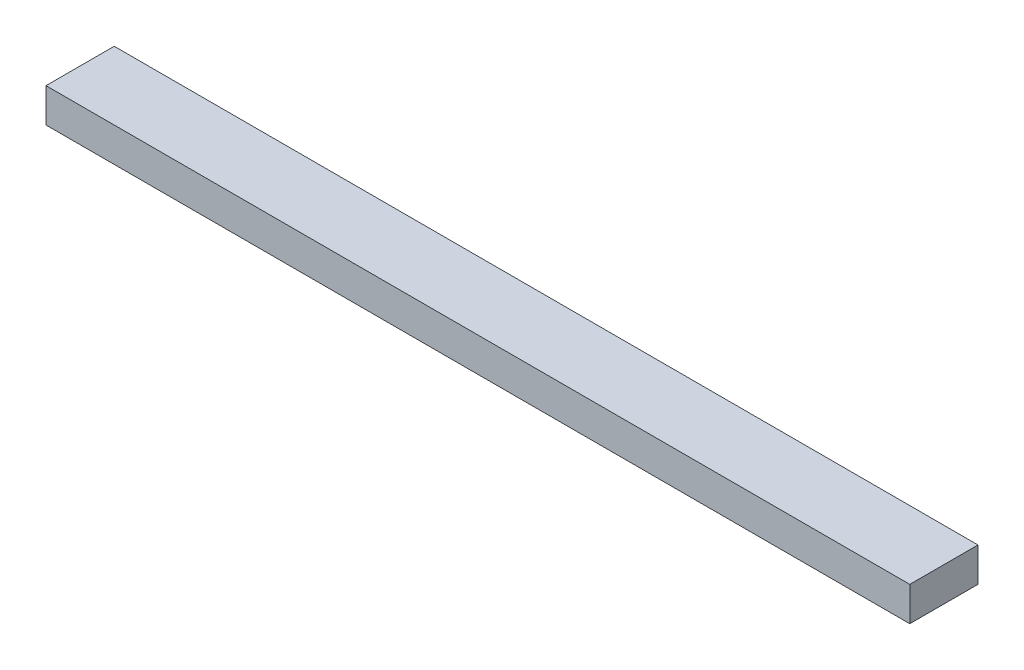
ISO-10303-21;
HEADER;
FILE_DESCRIPTION(('STEP AP214'),'2;1');
FILE_NAME('part.step','',(''),(''),'','','');
FILE_SCHEMA(('AUTOMOTIVE_DESIGN { 1 0 10303 214 1 1 1 1 }'));
ENDSEC;
DATA;
#1=APPLICATION_CONTEXT('core data for automotive mechanical design processes');
#2=APPLICATION_PROTOCOL_DEFINITION('international standard','automotive_design',2000,#1);
#3=PRODUCT_CONTEXT('',#1,'mechanical');
#4=PRODUCT('Part','Part','',(#3));
#5=PRODUCT_RELATED_PRODUCT_CATEGORY('part','',(#4));
#6=PRODUCT_DEFINITION_FORMATION('','',#4);
#7=PRODUCT_DEFINITION_CONTEXT('part definition',#1,'design');
#8=PRODUCT_DEFINITION('design','',#6,#7);
#9=PRODUCT_DEFINITION_SHAPE('','',#8);
#10=(LENGTH_UNIT() NAMED_UNIT(*) SI_UNIT(.MILLI.,.METRE.));
#11=(NAMED_UNIT(*) PLANE_ANGLE_UNIT() SI_UNIT($,.RADIAN.));
#12=(NAMED_UNIT(*) SI_UNIT($,.STERADIAN.) SOLID_ANGLE_UNIT());
#13=UNCERTAINTY_MEASURE_WITH_UNIT(LENGTH_MEASURE(1.E-05),#10,'distance_accuracy_value','');
#14=(GEOMETRIC_REPRESENTATION_CONTEXT(3) GLOBAL_UNCERTAINTY_ASSIGNED_CONTEXT((#13)) GLOBAL_UNIT_ASSIGNED_CONTEXT((#10,
#11,#12)) REPRESENTATION_CONTEXT('',''));
#15=CARTESIAN_POINT('',(0.,0.,0.));
#16=DIRECTION('',(0.,0.,1.));
#17=DIRECTION('',(1.,0.,0.));
#18=AXIS2_PLACEMENT_3D('',#15,#16,#17);
#19=CARTESIAN_POINT('',(80.391,6.35,6.35));
#20=DIRECTION('',(-1.,0.,0.));
#21=DIRECTION('',(0.,0.,1.));
#22=AXIS2_PLACEMENT_3D('',#19,#20,#21);
#23=PLANE('',#22);
#24=DIRECTION('',(0.,0.,-1.));
#25=VECTOR('',#24,1.);
#26=CARTESIAN_POINT('',(80.391,0.,6.35));
#27=LINE('',#26,#25);
#28=CARTESIAN_POINT('',(80.391,0.,6.35));
#29=VERTEX_POINT('',#28);
#30=CARTESIAN_POINT('',(80.391,0.,-6.35));
#31=VERTEX_POINT('',#30);
#32=EDGE_CURVE('E96',#29,#31,#27,.T.);
#33=ORIENTED_EDGE('',*,*,#32,.T.);
#34=DIRECTION('',(0.,-1.,0.));
#35=VECTOR('',#34,1.);
#36=CARTESIAN_POINT('',(80.391,6.35,-6.35));
#37=LINE('',#36,#35);
#38=CARTESIAN_POINT('',(80.391,6.35,-6.35));
#39=VERTEX_POINT('',#38);
#40=EDGE_CURVE('E11',#39,#31,#37,.T.);
#41=ORIENTED_EDGE('',*,*,#40,.F.);
#42=DIRECTION('',(0.,0.,-1.));
#43=VECTOR('',#42,1.);
#44=CARTESIAN_POINT('',(80.391,6.35,6.35));
#45=LINE('',#44,#43);
#46=CARTESIAN_POINT('',(80.391,6.35,6.35));
#47=VERTEX_POINT('',#46);
#48=EDGE_CURVE('E84',#47,#39,#45,.T.);
#49=ORIENTED_EDGE('',*,*,#48,.F.);
#50=DIRECTION('',(0.,-1.,0.));
#51=VECTOR('',#50,1.);
#52=CARTESIAN_POINT('',(80.391,6.35,6.35));
#53=LINE('',#52,#51);
#54=EDGE_CURVE('E92',#47,#29,#53,.T.);
#55=ORIENTED_EDGE('',*,*,#54,.T.);
#56=EDGE_LOOP('',(#33,#41,#49,#55));
#57=FACE_BOUND('',#56,.T.);
#58=ADVANCED_FACE('F33',(#57),#23,.F.);
#59=CARTESIAN_POINT('',(-80.391,6.35,-6.35));
#60=DIRECTION('',(0.,0.,1.));
#61=DIRECTION('',(1.,0.,0.));
#62=AXIS2_PLACEMENT_3D('',#59,#60,#61);
#63=PLANE('',#62);
#64=DIRECTION('',(-1.,0.,0.));
#65=VECTOR('',#64,1.);
#66=CARTESIAN_POINT('',(-80.391,0.,-6.35));
#67=LINE('',#66,#65);
#68=CARTESIAN_POINT('',(-80.391,0.,-6.35));
#69=VERTEX_POINT('',#68);
#70=EDGE_CURVE('E88',#31,#69,#67,.T.);
#71=ORIENTED_EDGE('',*,*,#70,.T.);
#72=DIRECTION('',(0.,-1.,0.));
#73=VECTOR('',#72,1.);
#74=CARTESIAN_POINT('',(-80.391,6.35,-6.35));
#75=LINE('',#74,#73);
#76=CARTESIAN_POINT('',(-80.391,6.35,-6.35));
#77=VERTEX_POINT('',#76);
#78=EDGE_CURVE('E41',#77,#69,#75,.T.);
#79=ORIENTED_EDGE('',*,*,#78,.F.);
#80=DIRECTION('',(-1.,0.,0.));
#81=VECTOR('',#80,1.);
#82=CARTESIAN_POINT('',(-80.391,6.35,-6.35));
#83=LINE('',#82,#81);
#84=EDGE_CURVE('E79',#39,#77,#83,.T.);
#85=ORIENTED_EDGE('',*,*,#84,.F.);
#86=ORIENTED_EDGE('',*,*,#40,.T.);
#87=EDGE_LOOP('',(#71,#79,#85,#86));
#88=FACE_BOUND('',#87,.T.);
#89=ADVANCED_FACE('F87',(#88),#63,.F.);
#90=CARTESIAN_POINT('',(-80.391,6.35,6.35));
#91=DIRECTION('',(1.,0.,0.));
#92=DIRECTION('',(0.,0.,-1.));
#93=AXIS2_PLACEMENT_3D('',#90,#91,#92);
#94=PLANE('',#93);
#95=DIRECTION('',(0.,0.,1.));
#96=VECTOR('',#95,1.);
#97=CARTESIAN_POINT('',(-80.391,0.,6.35));
#98=LINE('',#97,#96);
#99=CARTESIAN_POINT('',(-80.391,0.,6.35));
#100=VERTEX_POINT('',#99);
#101=EDGE_CURVE('E66',#69,#100,#98,.T.);
#102=ORIENTED_EDGE('',*,*,#101,.T.);
#103=DIRECTION('',(0.,-1.,0.));
#104=VECTOR('',#103,1.);
#105=CARTESIAN_POINT('',(-80.391,6.35,6.35));
#106=LINE('',#105,#104);
#107=CARTESIAN_POINT('',(-80.391,6.35,6.35));
#108=VERTEX_POINT('',#107);
#109=EDGE_CURVE('E89',#108,#100,#106,.T.);
#110=ORIENTED_EDGE('',*,*,#109,.F.);
#111=DIRECTION('',(0.,0.,1.));
#112=VECTOR('',#111,1.);
#113=CARTESIAN_POINT('',(-80.391,6.35,6.35));
#114=LINE('',#113,#112);
#115=EDGE_CURVE('E82',#77,#108,#114,.T.);
#116=ORIENTED_EDGE('',*,*,#115,.F.);
#117=ORIENTED_EDGE('',*,*,#78,.T.);
#118=EDGE_LOOP('',(#102,#110,#116,#117));
#119=FACE_BOUND('',#118,.T.);
#120=ADVANCED_FACE('F90',(#119),#94,.F.);
#121=CARTESIAN_POINT('',(-80.391,6.35,6.35));
#122=DIRECTION('',(0.,0.,-1.));
#123=DIRECTION('',(-1.,0.,0.));
#124=AXIS2_PLACEMENT_3D('',#121,#122,#123);
#125=PLANE('',#124);
#126=DIRECTION('',(1.,0.,0.));
#127=VECTOR('',#126,1.);
#128=CARTESIAN_POINT('',(-80.391,0.,6.35));
#129=LINE('',#128,#127);
#130=EDGE_CURVE('E72',#100,#29,#129,.T.);
#131=ORIENTED_EDGE('',*,*,#130,.T.);
#132=ORIENTED_EDGE('',*,*,#54,.F.);
#133=DIRECTION('',(1.,0.,0.));
#134=VECTOR('',#133,1.);
#135=CARTESIAN_POINT('',(-80.391,6.35,6.35));
#136=LINE('',#135,#134);
#137=EDGE_CURVE('E49',#108,#47,#136,.T.);
#138=ORIENTED_EDGE('',*,*,#137,.F.);
#139=ORIENTED_EDGE('',*,*,#109,.T.);
#140=EDGE_LOOP('',(#131,#132,#138,#139));
#141=FACE_BOUND('',#140,.T.);
#142=ADVANCED_FACE('F103',(#141),#125,.F.);
#143=CARTESIAN_POINT('',(0.,6.35,0.));
#144=DIRECTION('',(0.,-1.,0.));
#145=DIRECTION('',(0.,0.,-1.));
#146=AXIS2_PLACEMENT_3D('',#143,#144,#145);
#147=PLANE('',#146);
#148=ORIENTED_EDGE('',*,*,#48,.T.);
#149=ORIENTED_EDGE('',*,*,#84,.T.);
#150=ORIENTED_EDGE('',*,*,#115,.T.);
#151=ORIENTED_EDGE('',*,*,#137,.T.);
#152=EDGE_LOOP('',(#148,#149,#150,#151));
#153=FACE_BOUND('',#152,.T.);
#154=ADVANCED_FACE('F80',(#153),#147,.F.);
#155=CARTESIAN_POINT('',(0.,0.,0.));
#156=DIRECTION('',(0.,-1.,0.));
#157=DIRECTION('',(0.,0.,-1.));
#158=AXIS2_PLACEMENT_3D('',#155,#156,#157);
#159=PLANE('',#158);
#160=ORIENTED_EDGE('',*,*,#32,.F.);
#161=ORIENTED_EDGE('',*,*,#130,.F.);
#162=ORIENTED_EDGE('',*,*,#101,.F.);
#163=ORIENTED_EDGE('',*,*,#70,.F.);
#164=EDGE_LOOP('',(#160,#161,#162,#163));
#165=FACE_BOUND('',#164,.T.);
#166=ADVANCED_FACE('F106',(#165),#159,.T.);
#167=CLOSED_SHELL('',(#58,#89,#120,#142,#154,#166));
#168=MANIFOLD_SOLID_BREP('B2',#167);
#169=ADVANCED_BREP_SHAPE_REPRESENTATION('',(#18,#168),#14);
#170=SHAPE_DEFINITION_REPRESENTATION(#9,#169);
ENDSEC;
END-ISO-10303-21;
